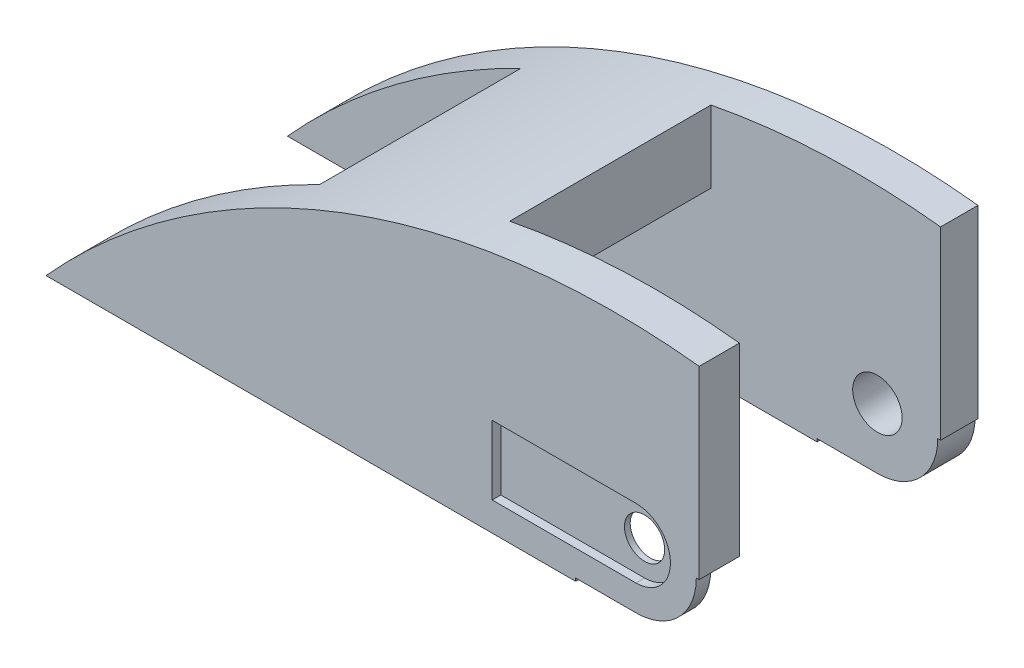
ISO-10303-21;
HEADER;
FILE_DESCRIPTION(('STEP AP214'),'2;1');
FILE_NAME('part.step','',(''),(''),'','','');
FILE_SCHEMA(('AUTOMOTIVE_DESIGN { 1 0 10303 214 1 1 1 1 }'));
ENDSEC;
DATA;
#1=APPLICATION_CONTEXT('core data for automotive mechanical design processes');
#2=APPLICATION_PROTOCOL_DEFINITION('international standard','automotive_design',2000,#1);
#3=PRODUCT_CONTEXT('',#1,'mechanical');
#4=PRODUCT('Part','Part','',(#3));
#5=PRODUCT_RELATED_PRODUCT_CATEGORY('part','',(#4));
#6=PRODUCT_DEFINITION_FORMATION('','',#4);
#7=PRODUCT_DEFINITION_CONTEXT('part definition',#1,'design');
#8=PRODUCT_DEFINITION('design','',#6,#7);
#9=PRODUCT_DEFINITION_SHAPE('','',#8);
#10=(LENGTH_UNIT() NAMED_UNIT(*) SI_UNIT(.MILLI.,.METRE.));
#11=(NAMED_UNIT(*) PLANE_ANGLE_UNIT() SI_UNIT($,.RADIAN.));
#12=(NAMED_UNIT(*) SI_UNIT($,.STERADIAN.) SOLID_ANGLE_UNIT());
#13=UNCERTAINTY_MEASURE_WITH_UNIT(LENGTH_MEASURE(1.E-05),#10,'distance_accuracy_value','');
#14=(GEOMETRIC_REPRESENTATION_CONTEXT(3) GLOBAL_UNCERTAINTY_ASSIGNED_CONTEXT((#13)) GLOBAL_UNIT_ASSIGNED_CONTEXT((#10,
#11,#12)) REPRESENTATION_CONTEXT('',''));
#15=CARTESIAN_POINT('',(0.,0.,0.));
#16=DIRECTION('',(0.,0.,1.));
#17=DIRECTION('',(1.,0.,0.));
#18=AXIS2_PLACEMENT_3D('',#15,#16,#17);
#19=CARTESIAN_POINT('',(0.,0.,0.));
#20=DIRECTION('',(0.,0.,1.));
#21=DIRECTION('',(1.,0.,0.));
#22=AXIS2_PLACEMENT_3D('',#19,#20,#21);
#23=PLANE('',#22);
#24=DIRECTION('',(-1.,0.,0.));
#25=VECTOR('',#24,1.);
#26=CARTESIAN_POINT('',(0.,0.,0.));
#27=LINE('',#26,#25);
#28=CARTESIAN_POINT('',(11.,0.,0.));
#29=VERTEX_POINT('',#28);
#30=CARTESIAN_POINT('',(10.5,0.,0.));
#31=VERTEX_POINT('',#30);
#32=EDGE_CURVE('E309',#29,#31,#27,.T.);
#33=ORIENTED_EDGE('',*,*,#32,.F.);
#34=DIRECTION('',(0.,-1.,0.));
#35=VECTOR('',#34,1.);
#36=CARTESIAN_POINT('',(11.,0.,0.));
#37=LINE('',#36,#35);
#38=CARTESIAN_POINT('',(11.,32.14,0.));
#39=VERTEX_POINT('',#38);
#40=EDGE_CURVE('E434',#39,#29,#37,.T.);
#41=ORIENTED_EDGE('',*,*,#40,.F.);
#42=CARTESIAN_POINT('',(-3.65048090000549,-100.467657861413,0.));
#43=DIRECTION('',(0.,0.,1.));
#44=DIRECTION('',(-1.,0.,0.));
#45=AXIS2_PLACEMENT_3D('',#42,#43,#44);
#46=CIRCLE('',#45,133.414495142361);
#47=CARTESIAN_POINT('',(-102.62,-11.,0.));
#48=VERTEX_POINT('',#47);
#49=EDGE_CURVE('E384',#39,#48,#46,.T.);
#50=ORIENTED_EDGE('',*,*,#49,.T.);
#51=DIRECTION('',(-1.,0.,0.));
#52=VECTOR('',#51,1.);
#53=CARTESIAN_POINT('',(0.,-11.,0.));
#54=LINE('',#53,#52);
#55=CARTESIAN_POINT('',(-10.5,-11.,0.));
#56=VERTEX_POINT('',#55);
#57=EDGE_CURVE('E426',#56,#48,#54,.T.);
#58=ORIENTED_EDGE('',*,*,#57,.F.);
#59=DIRECTION('',(0.,-1.,0.));
#60=VECTOR('',#59,1.);
#61=CARTESIAN_POINT('',(-10.5,0.,0.));
#62=LINE('',#61,#60);
#63=CARTESIAN_POINT('',(-10.5,-10.5,0.));
#64=VERTEX_POINT('',#63);
#65=EDGE_CURVE('E330',#64,#56,#62,.T.);
#66=ORIENTED_EDGE('',*,*,#65,.F.);
#67=DIRECTION('',(-1.,0.,0.));
#68=VECTOR('',#67,1.);
#69=CARTESIAN_POINT('',(0.,-10.5,0.));
#70=LINE('',#69,#68);
#71=CARTESIAN_POINT('',(0.,-10.5,0.));
#72=VERTEX_POINT('',#71);
#73=EDGE_CURVE('E326',#72,#64,#70,.T.);
#74=ORIENTED_EDGE('',*,*,#73,.F.);
#75=CARTESIAN_POINT('',(0.,0.,0.));
#76=DIRECTION('',(0.,0.,1.));
#77=DIRECTION('',(1.,0.,0.));
#78=AXIS2_PLACEMENT_3D('',#75,#76,#77);
#79=CIRCLE('',#78,10.5);
#80=EDGE_CURVE('E322',#72,#31,#79,.T.);
#81=ORIENTED_EDGE('',*,*,#80,.T.);
#82=EDGE_LOOP('',(#33,#41,#50,#58,#66,#74,#81));
#83=FACE_BOUND('',#82,.T.);
#84=CARTESIAN_POINT('',(0.,0.,0.));
#85=DIRECTION('',(0.,0.,1.));
#86=DIRECTION('',(1.,0.,0.));
#87=AXIS2_PLACEMENT_3D('',#84,#85,#86);
#88=CIRCLE('',#87,6.);
#89=CARTESIAN_POINT('',(0.,-6.,0.));
#90=VERTEX_POINT('',#89);
#91=CARTESIAN_POINT('',(0.,6.,0.));
#92=VERTEX_POINT('',#91);
#93=EDGE_CURVE('E256',#90,#92,#88,.T.);
#94=ORIENTED_EDGE('',*,*,#93,.F.);
#95=DIRECTION('',(-1.,0.,0.));
#96=VECTOR('',#95,1.);
#97=CARTESIAN_POINT('',(0.,-6.,0.));
#98=LINE('',#97,#96);
#99=CARTESIAN_POINT('',(-25.,-6.,0.));
#100=VERTEX_POINT('',#99);
#101=EDGE_CURVE('E65',#90,#100,#98,.T.);
#102=ORIENTED_EDGE('',*,*,#101,.T.);
#103=DIRECTION('',(0.,-1.,0.));
#104=VECTOR('',#103,1.);
#105=CARTESIAN_POINT('',(-25.,0.,0.));
#106=LINE('',#105,#104);
#107=CARTESIAN_POINT('',(-25.,6.,0.));
#108=VERTEX_POINT('',#107);
#109=EDGE_CURVE('E263',#108,#100,#106,.T.);
#110=ORIENTED_EDGE('',*,*,#109,.F.);
#111=DIRECTION('',(-1.,0.,0.));
#112=VECTOR('',#111,1.);
#113=CARTESIAN_POINT('',(0.,6.,0.));
#114=LINE('',#113,#112);
#115=EDGE_CURVE('E259',#92,#108,#114,.T.);
#116=ORIENTED_EDGE('',*,*,#115,.F.);
#117=EDGE_LOOP('',(#94,#102,#110,#116));
#118=FACE_BOUND('',#117,.T.);
#119=ADVANCED_FACE('F47',(#83,#118),#23,.T.);
#120=CARTESIAN_POINT('',(0.,0.,-21.75));
#121=DIRECTION('',(0.,0.,1.));
#122=DIRECTION('',(1.,0.,0.));
#123=AXIS2_PLACEMENT_3D('',#120,#121,#122);
#124=CYLINDRICAL_SURFACE('',#123,3.5);
#125=CARTESIAN_POINT('',(0.,0.,-2.5));
#126=DIRECTION('',(0.,0.,-1.));
#127=DIRECTION('',(0.,1.,0.));
#128=AXIS2_PLACEMENT_3D('',#125,#126,#127);
#129=CIRCLE('',#128,3.5);
#130=CARTESIAN_POINT('',(0.,3.5,-2.5));
#131=VERTEX_POINT('',#130);
#132=EDGE_CURVE('E51',#131,#131,#129,.T.);
#133=ORIENTED_EDGE('',*,*,#132,.T.);
#134=EDGE_LOOP('',(#133));
#135=FACE_BOUND('',#134,.T.);
#136=CARTESIAN_POINT('',(0.,0.,-1.5));
#137=DIRECTION('',(0.,0.,1.));
#138=DIRECTION('',(1.,0.,0.));
#139=AXIS2_PLACEMENT_3D('',#136,#137,#138);
#140=CIRCLE('',#139,3.5);
#141=CARTESIAN_POINT('',(3.5,0.,-1.5));
#142=VERTEX_POINT('',#141);
#143=EDGE_CURVE('E241',#142,#142,#140,.F.);
#144=ORIENTED_EDGE('',*,*,#143,.F.);
#145=EDGE_LOOP('',(#144));
#146=FACE_BOUND('',#145,.T.);
#147=ADVANCED_FACE('F607',(#135,#146),#124,.F.);
#148=CARTESIAN_POINT('',(12.,-12.,-7.));
#149=DIRECTION('',(0.,0.,1.));
#150=DIRECTION('',(0.,-1.,0.));
#151=AXIS2_PLACEMENT_3D('',#148,#149,#150);
#152=PLANE('',#151);
#153=DIRECTION('',(-1.,0.,0.));
#154=VECTOR('',#153,1.);
#155=CARTESIAN_POINT('',(12.,0.,-7.));
#156=LINE('',#155,#154);
#157=CARTESIAN_POINT('',(11.,0.,-7.00000000000001));
#158=VERTEX_POINT('',#157);
#159=CARTESIAN_POINT('',(9.5,0.,-7.));
#160=VERTEX_POINT('',#159);
#161=EDGE_CURVE('E361',#158,#160,#156,.T.);
#162=ORIENTED_EDGE('',*,*,#161,.T.);
#163=CARTESIAN_POINT('',(0.,0.,-7.));
#164=DIRECTION('',(0.,0.,-1.));
#165=DIRECTION('',(0.,1.,0.));
#166=AXIS2_PLACEMENT_3D('',#163,#164,#165);
#167=CIRCLE('',#166,9.5);
#168=CARTESIAN_POINT('',(-9.5,0.,-7.));
#169=VERTEX_POINT('',#168);
#170=EDGE_CURVE('E453',#169,#160,#167,.T.);
#171=ORIENTED_EDGE('',*,*,#170,.F.);
#172=DIRECTION('',(0.,1.,0.));
#173=VECTOR('',#172,1.);
#174=CARTESIAN_POINT('',(-9.5,-12.,-7.));
#175=LINE('',#174,#173);
#176=CARTESIAN_POINT('',(-9.5,-10.5,-7.00000000000001));
#177=VERTEX_POINT('',#176);
#178=EDGE_CURVE('E297',#177,#169,#175,.T.);
#179=ORIENTED_EDGE('',*,*,#178,.F.);
#180=DIRECTION('',(-1.,0.,0.));
#181=VECTOR('',#180,1.);
#182=CARTESIAN_POINT('',(12.,-10.5,-7.));
#183=LINE('',#182,#181);
#184=CARTESIAN_POINT('',(-10.5,-10.5,-7.00000000000001));
#185=VERTEX_POINT('',#184);
#186=EDGE_CURVE('E340',#177,#185,#183,.T.);
#187=ORIENTED_EDGE('',*,*,#186,.T.);
#188=DIRECTION('',(0.,-1.,0.));
#189=VECTOR('',#188,1.);
#190=CARTESIAN_POINT('',(-10.5,-12.,-7.));
#191=LINE('',#190,#189);
#192=CARTESIAN_POINT('',(-10.5,-11.,-7.00000000000001));
#193=VERTEX_POINT('',#192);
#194=EDGE_CURVE('E357',#185,#193,#191,.T.);
#195=ORIENTED_EDGE('',*,*,#194,.T.);
#196=DIRECTION('',(-1.,0.,0.));
#197=VECTOR('',#196,1.);
#198=CARTESIAN_POINT('',(0.,-11.,-7.));
#199=LINE('',#198,#197);
#200=CARTESIAN_POINT('',(-102.62,-11.,-7.));
#201=VERTEX_POINT('',#200);
#202=EDGE_CURVE('E427',#193,#201,#199,.T.);
#203=ORIENTED_EDGE('',*,*,#202,.T.);
#204=CARTESIAN_POINT('',(-3.65048090000549,-100.467657861413,-7.));
#205=DIRECTION('',(0.,0.,-1.));
#206=DIRECTION('',(-1.,0.,0.));
#207=AXIS2_PLACEMENT_3D('',#204,#205,#206);
#208=CIRCLE('',#207,133.414495142361);
#209=CARTESIAN_POINT('',(-62.0435913010327,19.489301802395,-7.));
#210=VERTEX_POINT('',#209);
#211=EDGE_CURVE('E479',#210,#201,#208,.F.);
#212=ORIENTED_EDGE('',*,*,#211,.F.);
#213=DIRECTION('',(0.,1.,0.));
#214=VECTOR('',#213,1.);
#215=CARTESIAN_POINT('',(-62.0435913010327,-11.,-7.));
#216=LINE('',#215,#214);
#217=CARTESIAN_POINT('',(-62.0435913010327,1.80739153991399,-7.));
#218=VERTEX_POINT('',#217);
#219=EDGE_CURVE('E368',#218,#210,#216,.T.);
#220=ORIENTED_EDGE('',*,*,#219,.F.);
#221=CARTESIAN_POINT('',(11.,-91.4878048780488,-6.99999999999999));
#222=DIRECTION('',(0.,0.,1.));
#223=DIRECTION('',(0.,-1.,0.));
#224=AXIS2_PLACEMENT_3D('',#221,#222,#223);
#225=CIRCLE('',#224,118.487804878049);
#226=CARTESIAN_POINT('',(-34.2965836217796,18.,-6.99999999999999));
#227=VERTEX_POINT('',#226);
#228=EDGE_CURVE('E419',#227,#218,#225,.T.);
#229=ORIENTED_EDGE('',*,*,#228,.F.);
#230=DIRECTION('',(1.,0.,0.));
#231=VECTOR('',#230,1.);
#232=CARTESIAN_POINT('',(0.,18.,-7.));
#233=LINE('',#232,#231);
#234=CARTESIAN_POINT('',(-28.9549396585655,18.,-7.));
#235=VERTEX_POINT('',#234);
#236=EDGE_CURVE('E430',#227,#235,#233,.T.);
#237=ORIENTED_EDGE('',*,*,#236,.T.);
#238=DIRECTION('',(0.,-1.,0.));
#239=VECTOR('',#238,1.);
#240=CARTESIAN_POINT('',(-28.9549396585655,38.5702227114121,-7.));
#241=LINE('',#240,#239);
#242=CARTESIAN_POINT('',(-28.9549396585655,30.5251353793884,-7.));
#243=VERTEX_POINT('',#242);
#244=EDGE_CURVE('E364',#243,#235,#241,.T.);
#245=ORIENTED_EDGE('',*,*,#244,.F.);
#246=CARTESIAN_POINT('',(-3.65048090000549,-100.467657861413,-7.));
#247=DIRECTION('',(0.,0.,-1.));
#248=DIRECTION('',(-1.,0.,0.));
#249=AXIS2_PLACEMENT_3D('',#246,#247,#248);
#250=CIRCLE('',#249,133.414495142361);
#251=CARTESIAN_POINT('',(11.,32.14,-7.));
#252=VERTEX_POINT('',#251);
#253=EDGE_CURVE('E467',#252,#243,#250,.F.);
#254=ORIENTED_EDGE('',*,*,#253,.F.);
#255=DIRECTION('',(0.,-1.,0.));
#256=VECTOR('',#255,1.);
#257=CARTESIAN_POINT('',(11.,-12.,-7.));
#258=LINE('',#257,#256);
#259=EDGE_CURVE('E448',#252,#158,#258,.T.);
#260=ORIENTED_EDGE('',*,*,#259,.T.);
#261=EDGE_LOOP('',(#162,#171,#179,#187,#195,#203,#212,#220,#229,#237,#245,#254,#260));
#262=FACE_BOUND('',#261,.T.);
#263=ADVANCED_FACE('F534',(#262),#152,.F.);
#264=CARTESIAN_POINT('',(0.,0.,-2.5));
#265=DIRECTION('',(0.,0.,-1.));
#266=DIRECTION('',(0.,1.,0.));
#267=AXIS2_PLACEMENT_3D('',#264,#265,#266);
#268=CYLINDRICAL_SURFACE('',#267,9.5);
#269=DIRECTION('',(0.,0.,-1.));
#270=VECTOR('',#269,1.);
#271=CARTESIAN_POINT('',(9.5,0.,-2.5));
#272=LINE('',#271,#270);
#273=CARTESIAN_POINT('',(9.5,0.,-2.5));
#274=VERTEX_POINT('',#273);
#275=EDGE_CURVE('E293',#274,#160,#272,.T.);
#276=ORIENTED_EDGE('',*,*,#275,.F.);
#277=CARTESIAN_POINT('',(0.,0.,-2.5));
#278=DIRECTION('',(0.,0.,-1.));
#279=DIRECTION('',(0.,1.,0.));
#280=AXIS2_PLACEMENT_3D('',#277,#278,#279);
#281=CIRCLE('',#280,9.5);
#282=CARTESIAN_POINT('',(-9.5,0.,-2.5));
#283=VERTEX_POINT('',#282);
#284=EDGE_CURVE('E452',#283,#274,#281,.T.);
#285=ORIENTED_EDGE('',*,*,#284,.F.);
#286=DIRECTION('',(0.,0.,-1.));
#287=VECTOR('',#286,1.);
#288=CARTESIAN_POINT('',(-9.5,0.,-2.5));
#289=LINE('',#288,#287);
#290=EDGE_CURVE('E289',#283,#169,#289,.T.);
#291=ORIENTED_EDGE('',*,*,#290,.T.);
#292=ORIENTED_EDGE('',*,*,#170,.T.);
#293=EDGE_LOOP('',(#276,#285,#291,#292));
#294=FACE_BOUND('',#293,.T.);
#295=ADVANCED_FACE('F590',(#294),#268,.F.);
#296=CARTESIAN_POINT('',(0.,-10.5,-48.5));
#297=DIRECTION('',(0.,1.,0.));
#298=DIRECTION('',(0.,0.,1.));
#299=AXIS2_PLACEMENT_3D('',#296,#297,#298);
#300=PLANE('',#299);
#301=DIRECTION('',(0.,0.,-1.));
#302=VECTOR('',#301,1.);
#303=CARTESIAN_POINT('',(-9.5,-10.5,-2.5));
#304=LINE('',#303,#302);
#305=CARTESIAN_POINT('',(-9.5,-10.5,-2.5));
#306=VERTEX_POINT('',#305);
#307=EDGE_CURVE('E286',#306,#177,#304,.T.);
#308=ORIENTED_EDGE('',*,*,#307,.F.);
#309=DIRECTION('',(-1.,0.,0.));
#310=VECTOR('',#309,1.);
#311=CARTESIAN_POINT('',(0.,-10.5,-2.5));
#312=LINE('',#311,#310);
#313=CARTESIAN_POINT('',(0.,-10.5,-2.50000000000002));
#314=VERTEX_POINT('',#313);
#315=EDGE_CURVE('E275',#314,#306,#312,.T.);
#316=ORIENTED_EDGE('',*,*,#315,.F.);
#317=DIRECTION('',(0.,0.,1.));
#318=VECTOR('',#317,1.);
#319=CARTESIAN_POINT('',(0.,-10.5,-48.5));
#320=LINE('',#319,#318);
#321=EDGE_CURVE('E321',#314,#72,#320,.T.);
#322=ORIENTED_EDGE('',*,*,#321,.T.);
#323=ORIENTED_EDGE('',*,*,#73,.T.);
#324=DIRECTION('',(0.,0.,1.));
#325=VECTOR('',#324,1.);
#326=CARTESIAN_POINT('',(-10.5,-10.5,-48.5));
#327=LINE('',#326,#325);
#328=EDGE_CURVE('E351',#185,#64,#327,.T.);
#329=ORIENTED_EDGE('',*,*,#328,.F.);
#330=ORIENTED_EDGE('',*,*,#186,.F.);
#331=EDGE_LOOP('',(#308,#316,#322,#323,#329,#330));
#332=FACE_BOUND('',#331,.T.);
#333=ADVANCED_FACE('F562',(#332),#300,.F.);
#334=CARTESIAN_POINT('',(12.,18.,-7.));
#335=DIRECTION('',(0.,1.,0.));
#336=DIRECTION('',(0.,0.,1.));
#337=AXIS2_PLACEMENT_3D('',#334,#335,#336);
#338=PLANE('',#337);
#339=DIRECTION('',(0.,0.,-1.));
#340=VECTOR('',#339,1.);
#341=CARTESIAN_POINT('',(-28.9549396585655,18.,-7.));
#342=LINE('',#341,#340);
#343=CARTESIAN_POINT('',(-28.9549396585655,18.,-42.));
#344=VERTEX_POINT('',#343);
#345=EDGE_CURVE('E373',#235,#344,#342,.T.);
#346=ORIENTED_EDGE('',*,*,#345,.F.);
#347=ORIENTED_EDGE('',*,*,#236,.F.);
#348=DIRECTION('',(0.,0.,1.));
#349=VECTOR('',#348,1.);
#350=CARTESIAN_POINT('',(-34.2965836217796,18.,-41.5));
#351=LINE('',#350,#349);
#352=CARTESIAN_POINT('',(-34.2965836217796,18.,-42.));
#353=VERTEX_POINT('',#352);
#354=EDGE_CURVE('E416',#353,#227,#351,.T.);
#355=ORIENTED_EDGE('',*,*,#354,.F.);
#356=DIRECTION('',(-1.,0.,0.));
#357=VECTOR('',#356,1.);
#358=CARTESIAN_POINT('',(0.,18.,-42.));
#359=LINE('',#358,#357);
#360=EDGE_CURVE('E405',#344,#353,#359,.T.);
#361=ORIENTED_EDGE('',*,*,#360,.F.);
#362=EDGE_LOOP('',(#346,#347,#355,#361));
#363=FACE_BOUND('',#362,.T.);
#364=ADVANCED_FACE('F542',(#363),#338,.F.);
#365=CARTESIAN_POINT('',(11.,0.,-48.5));
#366=DIRECTION('',(-1.,0.,0.));
#367=DIRECTION('',(0.,0.,1.));
#368=AXIS2_PLACEMENT_3D('',#365,#366,#367);
#369=PLANE('',#368);
#370=ORIENTED_EDGE('',*,*,#259,.F.);
#371=DIRECTION('',(0.,0.,1.));
#372=VECTOR('',#371,1.);
#373=CARTESIAN_POINT('',(11.,32.14,-48.5));
#374=LINE('',#373,#372);
#375=EDGE_CURVE('E398',#252,#39,#374,.T.);
#376=ORIENTED_EDGE('',*,*,#375,.T.);
#377=ORIENTED_EDGE('',*,*,#40,.T.);
#378=DIRECTION('',(0.,0.,1.));
#379=VECTOR('',#378,1.);
#380=CARTESIAN_POINT('',(11.,0.,-48.5));
#381=LINE('',#380,#379);
#382=EDGE_CURVE('E441',#158,#29,#381,.T.);
#383=ORIENTED_EDGE('',*,*,#382,.F.);
#384=EDGE_LOOP('',(#370,#376,#377,#383));
#385=FACE_BOUND('',#384,.T.);
#386=ADVANCED_FACE('F581',(#385),#369,.F.);
#387=CARTESIAN_POINT('',(0.,-11.,-7.));
#388=DIRECTION('',(0.,1.,0.));
#389=DIRECTION('',(-1.,0.,0.));
#390=AXIS2_PLACEMENT_3D('',#387,#388,#389);
#391=PLANE('',#390);
#392=ORIENTED_EDGE('',*,*,#202,.F.);
#393=DIRECTION('',(0.,0.,1.));
#394=VECTOR('',#393,1.);
#395=CARTESIAN_POINT('',(-10.5,-11.,-48.5));
#396=LINE('',#395,#394);
#397=EDGE_CURVE('E346',#193,#56,#396,.T.);
#398=ORIENTED_EDGE('',*,*,#397,.T.);
#399=ORIENTED_EDGE('',*,*,#57,.T.);
#400=DIRECTION('',(0.,0.,1.));
#401=VECTOR('',#400,1.);
#402=CARTESIAN_POINT('',(-102.62,-11.,-48.5));
#403=LINE('',#402,#401);
#404=EDGE_CURVE('E392',#201,#48,#403,.T.);
#405=ORIENTED_EDGE('',*,*,#404,.F.);
#406=EDGE_LOOP('',(#392,#398,#399,#405));
#407=FACE_BOUND('',#406,.T.);
#408=ADVANCED_FACE('F578',(#407),#391,.F.);
#409=CARTESIAN_POINT('',(11.,-91.4878048780488,-41.5));
#410=DIRECTION('',(0.,0.,1.));
#411=DIRECTION('',(1.,0.,0.));
#412=AXIS2_PLACEMENT_3D('',#409,#410,#411);
#413=CYLINDRICAL_SURFACE('',#412,118.487804878049);
#414=DIRECTION('',(0.,0.,1.));
#415=VECTOR('',#414,1.);
#416=CARTESIAN_POINT('',(-62.0435913010327,1.80739153991399,-41.5));
#417=LINE('',#416,#415);
#418=CARTESIAN_POINT('',(-62.0435913010327,1.80739153991399,-42.));
#419=VERTEX_POINT('',#418);
#420=EDGE_CURVE('E381',#419,#218,#417,.T.);
#421=ORIENTED_EDGE('',*,*,#420,.F.);
#422=CARTESIAN_POINT('',(11.,-91.4878048780488,-42.));
#423=DIRECTION('',(0.,0.,1.));
#424=DIRECTION('',(1.,0.,0.));
#425=AXIS2_PLACEMENT_3D('',#422,#423,#424);
#426=CIRCLE('',#425,118.487804878049);
#427=EDGE_CURVE('E408',#353,#419,#426,.T.);
#428=ORIENTED_EDGE('',*,*,#427,.F.);
#429=ORIENTED_EDGE('',*,*,#354,.T.);
#430=ORIENTED_EDGE('',*,*,#228,.T.);
#431=EDGE_LOOP('',(#421,#428,#429,#430));
#432=FACE_BOUND('',#431,.T.);
#433=ADVANCED_FACE('F537',(#432),#413,.F.);
#434=CARTESIAN_POINT('',(-3.65048090000549,-100.467657861413,-48.5));
#435=DIRECTION('',(0.,0.,1.));
#436=DIRECTION('',(1.,0.,0.));
#437=AXIS2_PLACEMENT_3D('',#434,#435,#436);
#438=CYLINDRICAL_SURFACE('',#437,133.414495142361);
#439=DIRECTION('',(0.,0.,1.));
#440=VECTOR('',#439,1.);
#441=CARTESIAN_POINT('',(-62.0435913010327,19.489301802395,-48.5));
#442=LINE('',#441,#440);
#443=CARTESIAN_POINT('',(-62.0435913010327,19.489301802395,-42.));
#444=VERTEX_POINT('',#443);
#445=EDGE_CURVE('E475',#444,#210,#442,.T.);
#446=ORIENTED_EDGE('',*,*,#445,.T.);
#447=ORIENTED_EDGE('',*,*,#211,.T.);
#448=ORIENTED_EDGE('',*,*,#404,.T.);
#449=ORIENTED_EDGE('',*,*,#49,.F.);
#450=ORIENTED_EDGE('',*,*,#375,.F.);
#451=ORIENTED_EDGE('',*,*,#253,.T.);
#452=DIRECTION('',(0.,0.,1.));
#453=VECTOR('',#452,1.);
#454=CARTESIAN_POINT('',(-28.9549396585655,30.5251353793883,-48.5));
#455=LINE('',#454,#453);
#456=CARTESIAN_POINT('',(-28.9549396585655,30.5251353793884,-42.));
#457=VERTEX_POINT('',#456);
#458=EDGE_CURVE('E463',#243,#457,#455,.F.);
#459=ORIENTED_EDGE('',*,*,#458,.T.);
#460=CARTESIAN_POINT('',(-3.65048090000549,-100.467657861413,-42.));
#461=DIRECTION('',(0.,0.,-1.));
#462=DIRECTION('',(-1.,0.,0.));
#463=AXIS2_PLACEMENT_3D('',#460,#461,#462);
#464=CIRCLE('',#463,133.414495142361);
#465=CARTESIAN_POINT('',(11.,32.14,-42.));
#466=VERTEX_POINT('',#465);
#467=EDGE_CURVE('E457',#466,#457,#464,.F.);
#468=ORIENTED_EDGE('',*,*,#467,.F.);
#469=CARTESIAN_POINT('',(11.,32.14,-48.5));
#470=VERTEX_POINT('',#469);
#471=EDGE_CURVE('E393',#470,#466,#374,.T.);
#472=ORIENTED_EDGE('',*,*,#471,.F.);
#473=CARTESIAN_POINT('',(-3.65048090000549,-100.467657861413,-48.5));
#474=DIRECTION('',(0.,0.,1.));
#475=DIRECTION('',(-1.,0.,0.));
#476=AXIS2_PLACEMENT_3D('',#473,#474,#475);
#477=CIRCLE('',#476,133.414495142361);
#478=CARTESIAN_POINT('',(-102.62,-11.,-48.5));
#479=VERTEX_POINT('',#478);
#480=EDGE_CURVE('E388',#470,#479,#477,.T.);
#481=ORIENTED_EDGE('',*,*,#480,.T.);
#482=CARTESIAN_POINT('',(-102.62,-11.,-42.));
#483=VERTEX_POINT('',#482);
#484=EDGE_CURVE('E399',#479,#483,#403,.T.);
#485=ORIENTED_EDGE('',*,*,#484,.T.);
#486=CARTESIAN_POINT('',(-3.65048090000549,-100.467657861413,-42.));
#487=DIRECTION('',(0.,0.,-1.));
#488=DIRECTION('',(-1.,0.,0.));
#489=AXIS2_PLACEMENT_3D('',#486,#487,#488);
#490=CIRCLE('',#489,133.414495142361);
#491=EDGE_CURVE('E471',#444,#483,#490,.F.);
#492=ORIENTED_EDGE('',*,*,#491,.F.);
#493=EDGE_LOOP('',(#446,#447,#448,#449,#450,#451,#459,#468,#472,#481,#485,#492));
#494=FACE_BOUND('',#493,.T.);
#495=ADVANCED_FACE('F517',(#494),#438,.T.);
#496=CARTESIAN_POINT('',(0.,0.,-48.5));
#497=DIRECTION('',(0.,0.,-1.));
#498=DIRECTION('',(-1.,0.,0.));
#499=AXIS2_PLACEMENT_3D('',#496,#497,#498);
#500=PLANE('',#499);
#501=CARTESIAN_POINT('',(0.,0.,-48.5));
#502=DIRECTION('',(0.,0.,1.));
#503=DIRECTION('',(1.,0.,0.));
#504=AXIS2_PLACEMENT_3D('',#501,#502,#503);
#505=CIRCLE('',#504,4.3);
#506=CARTESIAN_POINT('',(4.3,0.,-48.5));
#507=VERTEX_POINT('',#506);
#508=EDGE_CURVE('E300',#507,#507,#505,.T.);
#509=ORIENTED_EDGE('',*,*,#508,.T.);
#510=EDGE_LOOP('',(#509));
#511=FACE_BOUND('',#510,.T.);
#512=DIRECTION('',(-1.,0.,0.));
#513=VECTOR('',#512,1.);
#514=CARTESIAN_POINT('',(0.,0.,-48.5));
#515=LINE('',#514,#513);
#516=CARTESIAN_POINT('',(11.,0.,-48.5));
#517=VERTEX_POINT('',#516);
#518=CARTESIAN_POINT('',(10.5,0.,-48.5));
#519=VERTEX_POINT('',#518);
#520=EDGE_CURVE('E317',#517,#519,#515,.T.);
#521=ORIENTED_EDGE('',*,*,#520,.T.);
#522=CARTESIAN_POINT('',(0.,0.,-48.5));
#523=DIRECTION('',(0.,0.,1.));
#524=DIRECTION('',(1.,0.,0.));
#525=AXIS2_PLACEMENT_3D('',#522,#523,#524);
#526=CIRCLE('',#525,10.5);
#527=CARTESIAN_POINT('',(0.,-10.5,-48.5));
#528=VERTEX_POINT('',#527);
#529=EDGE_CURVE('E305',#528,#519,#526,.T.);
#530=ORIENTED_EDGE('',*,*,#529,.F.);
#531=DIRECTION('',(-1.,0.,0.));
#532=VECTOR('',#531,1.);
#533=CARTESIAN_POINT('',(0.,-10.5,-48.5));
#534=LINE('',#533,#532);
#535=CARTESIAN_POINT('',(-10.5,-10.5,-48.5));
#536=VERTEX_POINT('',#535);
#537=EDGE_CURVE('E308',#528,#536,#534,.T.);
#538=ORIENTED_EDGE('',*,*,#537,.T.);
#539=DIRECTION('',(0.,-1.,0.));
#540=VECTOR('',#539,1.);
#541=CARTESIAN_POINT('',(-10.5,0.,-48.5));
#542=LINE('',#541,#540);
#543=CARTESIAN_POINT('',(-10.5,-11.,-48.5));
#544=VERTEX_POINT('',#543);
#545=EDGE_CURVE('E313',#536,#544,#542,.T.);
#546=ORIENTED_EDGE('',*,*,#545,.T.);
#547=DIRECTION('',(-1.,0.,0.));
#548=VECTOR('',#547,1.);
#549=CARTESIAN_POINT('',(0.,-11.,-48.5));
#550=LINE('',#549,#548);
#551=EDGE_CURVE('E423',#544,#479,#550,.T.);
#552=ORIENTED_EDGE('',*,*,#551,.T.);
#553=ORIENTED_EDGE('',*,*,#480,.F.);
#554=DIRECTION('',(0.,-1.,0.));
#555=VECTOR('',#554,1.);
#556=CARTESIAN_POINT('',(11.,0.,-48.5));
#557=LINE('',#556,#555);
#558=EDGE_CURVE('E437',#470,#517,#557,.T.);
#559=ORIENTED_EDGE('',*,*,#558,.T.);
#560=EDGE_LOOP('',(#521,#530,#538,#546,#552,#553,#559));
#561=FACE_BOUND('',#560,.T.);
#562=ADVANCED_FACE('F519',(#511,#561),#500,.T.);
#563=CARTESIAN_POINT('',(0.,0.,-2.5));
#564=DIRECTION('',(0.,0.,-1.));
#565=DIRECTION('',(0.,1.,0.));
#566=AXIS2_PLACEMENT_3D('',#563,#564,#565);
#567=PLANE('',#566);
#568=ORIENTED_EDGE('',*,*,#132,.F.);
#569=EDGE_LOOP('',(#568));
#570=FACE_BOUND('',#569,.T.);
#571=ORIENTED_EDGE('',*,*,#284,.T.);
#572=DIRECTION('',(-1.,0.,0.));
#573=VECTOR('',#572,1.);
#574=CARTESIAN_POINT('',(0.,0.,-2.5));
#575=LINE('',#574,#573);
#576=CARTESIAN_POINT('',(10.5,0.,-2.5));
#577=VERTEX_POINT('',#576);
#578=EDGE_CURVE('E280',#577,#274,#575,.T.);
#579=ORIENTED_EDGE('',*,*,#578,.F.);
#580=CARTESIAN_POINT('',(0.,0.,-2.5));
#581=DIRECTION('',(0.,0.,1.));
#582=DIRECTION('',(1.,0.,0.));
#583=AXIS2_PLACEMENT_3D('',#580,#581,#582);
#584=CIRCLE('',#583,10.5);
#585=EDGE_CURVE('E73',#314,#577,#584,.T.);
#586=ORIENTED_EDGE('',*,*,#585,.F.);
#587=ORIENTED_EDGE('',*,*,#315,.T.);
#588=DIRECTION('',(0.,-1.,0.));
#589=VECTOR('',#588,1.);
#590=CARTESIAN_POINT('',(-9.5,0.,-2.5));
#591=LINE('',#590,#589);
#592=EDGE_CURVE('E283',#283,#306,#591,.T.);
#593=ORIENTED_EDGE('',*,*,#592,.F.);
#594=EDGE_LOOP('',(#571,#579,#586,#587,#593));
#595=FACE_BOUND('',#594,.T.);
#596=ADVANCED_FACE('F49',(#570,#595),#567,.T.);
#597=ORIENTED_EDGE('',*,*,#471,.T.);
#598=DIRECTION('',(0.,1.,0.));
#599=VECTOR('',#598,1.);
#600=CARTESIAN_POINT('',(11.,0.,-42.));
#601=LINE('',#600,#599);
#602=CARTESIAN_POINT('',(11.,0.,-42.));
#603=VERTEX_POINT('',#602);
#604=EDGE_CURVE('E397',#603,#466,#601,.T.);
#605=ORIENTED_EDGE('',*,*,#604,.F.);
#606=EDGE_CURVE('E445',#517,#603,#381,.T.);
#607=ORIENTED_EDGE('',*,*,#606,.F.);
#608=ORIENTED_EDGE('',*,*,#558,.F.);
#609=EDGE_LOOP('',(#597,#605,#607,#608));
#610=FACE_BOUND('',#609,.T.);
#611=ADVANCED_FACE('F513',(#610),#369,.F.);
#612=ORIENTED_EDGE('',*,*,#551,.F.);
#613=CARTESIAN_POINT('',(-10.5,-11.,-42.));
#614=VERTEX_POINT('',#613);
#615=EDGE_CURVE('E342',#544,#614,#396,.T.);
#616=ORIENTED_EDGE('',*,*,#615,.T.);
#617=DIRECTION('',(1.,0.,0.));
#618=VECTOR('',#617,1.);
#619=CARTESIAN_POINT('',(0.,-11.,-42.));
#620=LINE('',#619,#618);
#621=EDGE_CURVE('E412',#483,#614,#620,.T.);
#622=ORIENTED_EDGE('',*,*,#621,.F.);
#623=ORIENTED_EDGE('',*,*,#484,.F.);
#624=EDGE_LOOP('',(#612,#616,#622,#623));
#625=FACE_BOUND('',#624,.T.);
#626=ADVANCED_FACE('F502',(#625),#391,.F.);
#627=CARTESIAN_POINT('',(0.,0.,-42.));
#628=DIRECTION('',(0.,0.,1.));
#629=DIRECTION('',(1.,0.,0.));
#630=AXIS2_PLACEMENT_3D('',#627,#628,#629);
#631=PLANE('',#630);
#632=CARTESIAN_POINT('',(0.,0.,-42.));
#633=DIRECTION('',(0.,0.,1.));
#634=DIRECTION('',(1.,0.,0.));
#635=AXIS2_PLACEMENT_3D('',#632,#633,#634);
#636=CIRCLE('',#635,4.3);
#637=CARTESIAN_POINT('',(4.3,0.,-42.));
#638=VERTEX_POINT('',#637);
#639=EDGE_CURVE('E304',#638,#638,#636,.T.);
#640=ORIENTED_EDGE('',*,*,#639,.F.);
#641=EDGE_LOOP('',(#640));
#642=FACE_BOUND('',#641,.T.);
#643=DIRECTION('',(-1.,0.,0.));
#644=VECTOR('',#643,1.);
#645=CARTESIAN_POINT('',(0.,0.,-42.));
#646=LINE('',#645,#644);
#647=CARTESIAN_POINT('',(10.5,0.,-42.));
#648=VERTEX_POINT('',#647);
#649=EDGE_CURVE('E11',#603,#648,#646,.T.);
#650=ORIENTED_EDGE('',*,*,#649,.F.);
#651=ORIENTED_EDGE('',*,*,#604,.T.);
#652=ORIENTED_EDGE('',*,*,#467,.T.);
#653=DIRECTION('',(0.,-1.,0.));
#654=VECTOR('',#653,1.);
#655=CARTESIAN_POINT('',(-28.9549396585655,38.5702227114121,-42.));
#656=LINE('',#655,#654);
#657=EDGE_CURVE('E369',#457,#344,#656,.T.);
#658=ORIENTED_EDGE('',*,*,#657,.T.);
#659=ORIENTED_EDGE('',*,*,#360,.T.);
#660=ORIENTED_EDGE('',*,*,#427,.T.);
#661=DIRECTION('',(0.,1.,0.));
#662=VECTOR('',#661,1.);
#663=CARTESIAN_POINT('',(-62.0435913010327,-11.,-42.));
#664=LINE('',#663,#662);
#665=EDGE_CURVE('E365',#419,#444,#664,.T.);
#666=ORIENTED_EDGE('',*,*,#665,.T.);
#667=ORIENTED_EDGE('',*,*,#491,.T.);
#668=ORIENTED_EDGE('',*,*,#621,.T.);
#669=DIRECTION('',(0.,-1.,0.));
#670=VECTOR('',#669,1.);
#671=CARTESIAN_POINT('',(-10.5,0.,-42.));
#672=LINE('',#671,#670);
#673=CARTESIAN_POINT('',(-10.5,-10.5,-42.));
#674=VERTEX_POINT('',#673);
#675=EDGE_CURVE('E486',#674,#614,#672,.T.);
#676=ORIENTED_EDGE('',*,*,#675,.F.);
#677=DIRECTION('',(-1.,0.,0.));
#678=VECTOR('',#677,1.);
#679=CARTESIAN_POINT('',(0.,-10.5,-42.));
#680=LINE('',#679,#678);
#681=CARTESIAN_POINT('',(0.,-10.5,-42.));
#682=VERTEX_POINT('',#681);
#683=EDGE_CURVE('E483',#682,#674,#680,.T.);
#684=ORIENTED_EDGE('',*,*,#683,.F.);
#685=CARTESIAN_POINT('',(0.,0.,-42.));
#686=DIRECTION('',(0.,0.,1.));
#687=DIRECTION('',(1.,0.,0.));
#688=AXIS2_PLACEMENT_3D('',#685,#686,#687);
#689=CIRCLE('',#688,10.5);
#690=EDGE_CURVE('E57',#682,#648,#689,.T.);
#691=ORIENTED_EDGE('',*,*,#690,.T.);
#692=EDGE_LOOP('',(#650,#651,#652,#658,#659,#660,#666,#667,#668,#676,#684,#691));
#693=FACE_BOUND('',#692,.T.);
#694=ADVANCED_FACE('F498',(#642,#693),#631,.T.);
#695=CARTESIAN_POINT('',(-28.9549396585655,38.5702227114121,-7.));
#696=DIRECTION('',(1.,0.,0.));
#697=DIRECTION('',(0.,0.,-1.));
#698=AXIS2_PLACEMENT_3D('',#695,#696,#697);
#699=PLANE('',#698);
#700=ORIENTED_EDGE('',*,*,#345,.T.);
#701=ORIENTED_EDGE('',*,*,#657,.F.);
#702=ORIENTED_EDGE('',*,*,#458,.F.);
#703=ORIENTED_EDGE('',*,*,#244,.T.);
#704=EDGE_LOOP('',(#700,#701,#702,#703));
#705=FACE_BOUND('',#704,.T.);
#706=ADVANCED_FACE('F501',(#705),#699,.T.);
#707=CARTESIAN_POINT('',(-62.0435913010327,-11.,-7.));
#708=DIRECTION('',(-1.,0.,0.));
#709=DIRECTION('',(0.,0.,1.));
#710=AXIS2_PLACEMENT_3D('',#707,#708,#709);
#711=PLANE('',#710);
#712=ORIENTED_EDGE('',*,*,#420,.T.);
#713=ORIENTED_EDGE('',*,*,#219,.T.);
#714=ORIENTED_EDGE('',*,*,#445,.F.);
#715=ORIENTED_EDGE('',*,*,#665,.F.);
#716=EDGE_LOOP('',(#712,#713,#714,#715));
#717=FACE_BOUND('',#716,.T.);
#718=ADVANCED_FACE('F530',(#717),#711,.T.);
#719=CARTESIAN_POINT('',(0.,0.,-48.5));
#720=DIRECTION('',(0.,1.,0.));
#721=DIRECTION('',(0.,0.,1.));
#722=AXIS2_PLACEMENT_3D('',#719,#720,#721);
#723=PLANE('',#722);
#724=ORIENTED_EDGE('',*,*,#649,.T.);
#725=DIRECTION('',(0.,0.,1.));
#726=VECTOR('',#725,1.);
#727=CARTESIAN_POINT('',(10.5,0.,-48.5));
#728=LINE('',#727,#726);
#729=EDGE_CURVE('E336',#519,#648,#728,.T.);
#730=ORIENTED_EDGE('',*,*,#729,.F.);
#731=ORIENTED_EDGE('',*,*,#520,.F.);
#732=ORIENTED_EDGE('',*,*,#606,.T.);
#733=EDGE_LOOP('',(#724,#730,#731,#732));
#734=FACE_BOUND('',#733,.T.);
#735=ADVANCED_FACE('F631',(#734),#723,.F.);
#736=ORIENTED_EDGE('',*,*,#683,.T.);
#737=EDGE_CURVE('E347',#536,#674,#327,.T.);
#738=ORIENTED_EDGE('',*,*,#737,.F.);
#739=ORIENTED_EDGE('',*,*,#537,.F.);
#740=EDGE_CURVE('E352',#528,#682,#320,.T.);
#741=ORIENTED_EDGE('',*,*,#740,.T.);
#742=EDGE_LOOP('',(#736,#738,#739,#741));
#743=FACE_BOUND('',#742,.T.);
#744=ADVANCED_FACE('F623',(#743),#300,.F.);
#745=CARTESIAN_POINT('',(-10.5,0.,-48.5));
#746=DIRECTION('',(-1.,0.,0.));
#747=DIRECTION('',(0.,0.,1.));
#748=AXIS2_PLACEMENT_3D('',#745,#746,#747);
#749=PLANE('',#748);
#750=ORIENTED_EDGE('',*,*,#675,.T.);
#751=ORIENTED_EDGE('',*,*,#615,.F.);
#752=ORIENTED_EDGE('',*,*,#545,.F.);
#753=ORIENTED_EDGE('',*,*,#737,.T.);
#754=EDGE_LOOP('',(#750,#751,#752,#753));
#755=FACE_BOUND('',#754,.T.);
#756=ADVANCED_FACE('F630',(#755),#749,.F.);
#757=CARTESIAN_POINT('',(0.,0.,-48.5));
#758=DIRECTION('',(0.,0.,1.));
#759=DIRECTION('',(1.,0.,0.));
#760=AXIS2_PLACEMENT_3D('',#757,#758,#759);
#761=CYLINDRICAL_SURFACE('',#760,10.5);
#762=ORIENTED_EDGE('',*,*,#740,.F.);
#763=ORIENTED_EDGE('',*,*,#529,.T.);
#764=ORIENTED_EDGE('',*,*,#729,.T.);
#765=ORIENTED_EDGE('',*,*,#690,.F.);
#766=EDGE_LOOP('',(#762,#763,#764,#765));
#767=FACE_BOUND('',#766,.T.);
#768=ADVANCED_FACE('F637',(#767),#761,.T.);
#769=ORIENTED_EDGE('',*,*,#585,.T.);
#770=EDGE_CURVE('E341',#577,#31,#728,.T.);
#771=ORIENTED_EDGE('',*,*,#770,.T.);
#772=ORIENTED_EDGE('',*,*,#80,.F.);
#773=ORIENTED_EDGE('',*,*,#321,.F.);
#774=EDGE_LOOP('',(#769,#771,#772,#773));
#775=FACE_BOUND('',#774,.T.);
#776=ADVANCED_FACE('F567',(#775),#761,.T.);
#777=ORIENTED_EDGE('',*,*,#382,.T.);
#778=ORIENTED_EDGE('',*,*,#32,.T.);
#779=ORIENTED_EDGE('',*,*,#770,.F.);
#780=ORIENTED_EDGE('',*,*,#578,.T.);
#781=ORIENTED_EDGE('',*,*,#275,.T.);
#782=ORIENTED_EDGE('',*,*,#161,.F.);
#783=EDGE_LOOP('',(#777,#778,#779,#780,#781,#782));
#784=FACE_BOUND('',#783,.T.);
#785=ADVANCED_FACE('F584',(#784),#723,.F.);
#786=ORIENTED_EDGE('',*,*,#328,.T.);
#787=ORIENTED_EDGE('',*,*,#65,.T.);
#788=ORIENTED_EDGE('',*,*,#397,.F.);
#789=ORIENTED_EDGE('',*,*,#194,.F.);
#790=EDGE_LOOP('',(#786,#787,#788,#789));
#791=FACE_BOUND('',#790,.T.);
#792=ADVANCED_FACE('F574',(#791),#749,.F.);
#793=CARTESIAN_POINT('',(0.,0.,-48.5));
#794=DIRECTION('',(0.,0.,1.));
#795=DIRECTION('',(1.,0.,0.));
#796=AXIS2_PLACEMENT_3D('',#793,#794,#795);
#797=CYLINDRICAL_SURFACE('',#796,4.3);
#798=CARTESIAN_POINT('',(4.3,0.,-42.));
#799=CARTESIAN_POINT('',(4.3,0.,-42.0677083333333));
#800=CARTESIAN_POINT('',(4.3,0.,-42.1354166666667));
#801=CARTESIAN_POINT('',(4.3,0.,-42.2708333333333));
#802=CARTESIAN_POINT('',(4.3,0.,-42.3385416666667));
#803=CARTESIAN_POINT('',(4.3,0.,-42.4739583333333));
#804=CARTESIAN_POINT('',(4.3,0.,-42.5416666666667));
#805=CARTESIAN_POINT('',(4.3,0.,-42.6770833333333));
#806=CARTESIAN_POINT('',(4.3,0.,-42.7447916666667));
#807=CARTESIAN_POINT('',(4.3,0.,-42.8802083333333));
#808=CARTESIAN_POINT('',(4.3,0.,-42.9479166666667));
#809=CARTESIAN_POINT('',(4.3,0.,-43.0833333333333));
#810=CARTESIAN_POINT('',(4.3,0.,-43.1510416666667));
#811=CARTESIAN_POINT('',(4.3,0.,-43.2864583333333));
#812=CARTESIAN_POINT('',(4.3,0.,-43.3541666666667));
#813=CARTESIAN_POINT('',(4.3,0.,-43.4895833333333));
#814=CARTESIAN_POINT('',(4.3,0.,-43.5572916666667));
#815=CARTESIAN_POINT('',(4.3,0.,-43.6927083333333));
#816=CARTESIAN_POINT('',(4.3,0.,-43.7604166666667));
#817=CARTESIAN_POINT('',(4.3,0.,-43.8958333333333));
#818=CARTESIAN_POINT('',(4.3,0.,-43.9635416666667));
#819=CARTESIAN_POINT('',(4.3,0.,-44.0989583333333));
#820=CARTESIAN_POINT('',(4.3,0.,-44.1666666666667));
#821=CARTESIAN_POINT('',(4.3,0.,-44.3020833333333));
#822=CARTESIAN_POINT('',(4.3,0.,-44.3697916666667));
#823=CARTESIAN_POINT('',(4.3,0.,-44.5052083333333));
#824=CARTESIAN_POINT('',(4.3,0.,-44.5729166666667));
#825=CARTESIAN_POINT('',(4.3,0.,-44.7083333333333));
#826=CARTESIAN_POINT('',(4.3,0.,-44.7760416666667));
#827=CARTESIAN_POINT('',(4.3,0.,-44.9114583333333));
#828=CARTESIAN_POINT('',(4.3,0.,-44.9791666666667));
#829=CARTESIAN_POINT('',(4.3,0.,-45.1145833333333));
#830=CARTESIAN_POINT('',(4.3,0.,-45.1822916666667));
#831=CARTESIAN_POINT('',(4.3,0.,-45.3177083333333));
#832=CARTESIAN_POINT('',(4.3,0.,-45.3854166666667));
#833=CARTESIAN_POINT('',(4.3,0.,-45.5208333333333));
#834=CARTESIAN_POINT('',(4.3,0.,-45.5885416666667));
#835=CARTESIAN_POINT('',(4.3,0.,-45.7239583333333));
#836=CARTESIAN_POINT('',(4.3,0.,-45.7916666666667));
#837=CARTESIAN_POINT('',(4.3,0.,-45.9270833333333));
#838=CARTESIAN_POINT('',(4.3,0.,-45.9947916666667));
#839=CARTESIAN_POINT('',(4.3,0.,-46.1302083333333));
#840=CARTESIAN_POINT('',(4.3,0.,-46.1979166666667));
#841=CARTESIAN_POINT('',(4.3,0.,-46.3333333333333));
#842=CARTESIAN_POINT('',(4.3,0.,-46.4010416666667));
#843=CARTESIAN_POINT('',(4.3,0.,-46.5364583333333));
#844=CARTESIAN_POINT('',(4.3,0.,-46.6041666666667));
#845=CARTESIAN_POINT('',(4.3,0.,-46.7395833333333));
#846=CARTESIAN_POINT('',(4.3,0.,-46.8072916666667));
#847=CARTESIAN_POINT('',(4.3,0.,-46.9427083333333));
#848=CARTESIAN_POINT('',(4.3,0.,-47.0104166666667));
#849=CARTESIAN_POINT('',(4.3,0.,-47.1458333333333));
#850=CARTESIAN_POINT('',(4.3,0.,-47.2135416666667));
#851=CARTESIAN_POINT('',(4.3,0.,-47.3489583333333));
#852=CARTESIAN_POINT('',(4.3,0.,-47.4166666666667));
#853=CARTESIAN_POINT('',(4.3,0.,-47.5520833333333));
#854=CARTESIAN_POINT('',(4.3,0.,-47.6197916666667));
#855=CARTESIAN_POINT('',(4.3,0.,-47.7552083333333));
#856=CARTESIAN_POINT('',(4.3,0.,-47.8229166666667));
#857=CARTESIAN_POINT('',(4.3,0.,-47.9583333333333));
#858=CARTESIAN_POINT('',(4.3,0.,-48.0260416666667));
#859=CARTESIAN_POINT('',(4.3,0.,-48.1614583333333));
#860=CARTESIAN_POINT('',(4.3,0.,-48.2291666666667));
#861=CARTESIAN_POINT('',(4.3,0.,-48.3645833333333));
#862=CARTESIAN_POINT('',(4.3,0.,-48.4322916666667));
#863=CARTESIAN_POINT('',(4.3,0.,-48.5));
#864=B_SPLINE_CURVE_WITH_KNOTS('',3,(#798,#799,#800,#801,#802,#803,#804,#805,#806,#807,#808,
#809,#810,#811,#812,#813,#814,#815,#816,#817,#818,#819,#820,#821,#822,#823,#824,#825,#826,#827,
#828,#829,#830,#831,#832,#833,#834,#835,#836,#837,#838,#839,#840,#841,#842,#843,#844,#845,#846,
#847,#848,#849,#850,#851,#852,#853,#854,#855,#856,#857,#858,#859,#860,#861,#862,#863),
.UNSPECIFIED.,.F.,.F.,(4,2,2,2,2,2,2,2,2,2,2,2,2,2,2,2,2,2,2,2,2,2,2,2,2,2,2,2,2,2,2,2,4),(0.,
0.203125000000005,0.406250000000004,0.609375000000002,0.812500000000001,1.015625,1.21875,
1.421875,1.625,1.828125,2.03125000000001,2.234375,2.4375,2.640625,2.84375,3.046875,3.25,
3.453125,3.65625,3.85937500000001,4.0625,4.265625,4.46875,4.67187500000001,4.875,5.078125,
5.28125,5.484375,5.68750000000001,5.890625,6.09375,6.296875,6.5),.UNSPECIFIED.);
#865=EDGE_CURVE('BSEAM495',#638,#507,#864,.T.);
#866=ORIENTED_EDGE('',*,*,#639,.T.);
#867=ORIENTED_EDGE('',*,*,#508,.F.);
#868=ORIENTED_EDGE('',*,*,#865,.T.);
#869=ORIENTED_EDGE('',*,*,#865,.F.);
#870=EDGE_LOOP('',(#866,#868,#867,#869));
#871=FACE_BOUND('',#870,.T.);
#872=ADVANCED_FACE('F495',(#871),#797,.F.);
#873=CARTESIAN_POINT('',(-9.5,0.,-2.5));
#874=DIRECTION('',(1.,0.,0.));
#875=DIRECTION('',(0.,0.,-1.));
#876=AXIS2_PLACEMENT_3D('',#873,#874,#875);
#877=PLANE('',#876);
#878=ORIENTED_EDGE('',*,*,#178,.T.);
#879=ORIENTED_EDGE('',*,*,#290,.F.);
#880=ORIENTED_EDGE('',*,*,#592,.T.);
#881=ORIENTED_EDGE('',*,*,#307,.T.);
#882=EDGE_LOOP('',(#878,#879,#880,#881));
#883=FACE_BOUND('',#882,.T.);
#884=ADVANCED_FACE('F594',(#883),#877,.T.);
#885=CARTESIAN_POINT('',(0.,-6.,-1.5));
#886=DIRECTION('',(0.,1.,0.));
#887=DIRECTION('',(-1.,0.,0.));
#888=AXIS2_PLACEMENT_3D('',#885,#886,#887);
#889=PLANE('',#888);
#890=ORIENTED_EDGE('',*,*,#101,.F.);
#891=DIRECTION('',(0.,0.,1.));
#892=VECTOR('',#891,1.);
#893=CARTESIAN_POINT('',(0.,-6.,-1.5));
#894=LINE('',#893,#892);
#895=CARTESIAN_POINT('',(0.,-6.,-1.5));
#896=VERTEX_POINT('',#895);
#897=EDGE_CURVE('E220',#896,#90,#894,.T.);
#898=ORIENTED_EDGE('',*,*,#897,.F.);
#899=DIRECTION('',(-1.,0.,0.));
#900=VECTOR('',#899,1.);
#901=CARTESIAN_POINT('',(0.,-6.,-1.5));
#902=LINE('',#901,#900);
#903=CARTESIAN_POINT('',(-25.,-6.,-1.5));
#904=VERTEX_POINT('',#903);
#905=EDGE_CURVE('E223',#896,#904,#902,.T.);
#906=ORIENTED_EDGE('',*,*,#905,.T.);
#907=DIRECTION('',(0.,0.,1.));
#908=VECTOR('',#907,1.);
#909=CARTESIAN_POINT('',(-25.,-6.,-1.5));
#910=LINE('',#909,#908);
#911=EDGE_CURVE('E267',#904,#100,#910,.T.);
#912=ORIENTED_EDGE('',*,*,#911,.T.);
#913=EDGE_LOOP('',(#890,#898,#906,#912));
#914=FACE_BOUND('',#913,.T.);
#915=ADVANCED_FACE('F222',(#914),#889,.T.);
#916=CARTESIAN_POINT('',(-25.,0.,-1.5));
#917=DIRECTION('',(-1.,0.,0.));
#918=DIRECTION('',(0.,0.,1.));
#919=AXIS2_PLACEMENT_3D('',#916,#917,#918);
#920=PLANE('',#919);
#921=ORIENTED_EDGE('',*,*,#109,.T.);
#922=ORIENTED_EDGE('',*,*,#911,.F.);
#923=DIRECTION('',(0.,-1.,0.));
#924=VECTOR('',#923,1.);
#925=CARTESIAN_POINT('',(-25.,0.,-1.5));
#926=LINE('',#925,#924);
#927=CARTESIAN_POINT('',(-25.,6.,-1.5));
#928=VERTEX_POINT('',#927);
#929=EDGE_CURVE('E231',#928,#904,#926,.T.);
#930=ORIENTED_EDGE('',*,*,#929,.F.);
#931=DIRECTION('',(0.,0.,1.));
#932=VECTOR('',#931,1.);
#933=CARTESIAN_POINT('',(-25.,6.,-1.5));
#934=LINE('',#933,#932);
#935=EDGE_CURVE('E270',#928,#108,#934,.T.);
#936=ORIENTED_EDGE('',*,*,#935,.T.);
#937=EDGE_LOOP('',(#921,#922,#930,#936));
#938=FACE_BOUND('',#937,.T.);
#939=ADVANCED_FACE('F785',(#938),#920,.F.);
#940=CARTESIAN_POINT('',(0.,6.,-1.5));
#941=DIRECTION('',(0.,1.,0.));
#942=DIRECTION('',(-1.,0.,0.));
#943=AXIS2_PLACEMENT_3D('',#940,#941,#942);
#944=PLANE('',#943);
#945=ORIENTED_EDGE('',*,*,#115,.T.);
#946=ORIENTED_EDGE('',*,*,#935,.F.);
#947=DIRECTION('',(-1.,0.,0.));
#948=VECTOR('',#947,1.);
#949=CARTESIAN_POINT('',(0.,6.,-1.5));
#950=LINE('',#949,#948);
#951=CARTESIAN_POINT('',(0.,6.,-1.5));
#952=VERTEX_POINT('',#951);
#953=EDGE_CURVE('E246',#952,#928,#950,.T.);
#954=ORIENTED_EDGE('',*,*,#953,.F.);
#955=DIRECTION('',(0.,0.,1.));
#956=VECTOR('',#955,1.);
#957=CARTESIAN_POINT('',(0.,6.,-1.5));
#958=LINE('',#957,#956);
#959=EDGE_CURVE('E230',#952,#92,#958,.T.);
#960=ORIENTED_EDGE('',*,*,#959,.T.);
#961=EDGE_LOOP('',(#945,#946,#954,#960));
#962=FACE_BOUND('',#961,.T.);
#963=ADVANCED_FACE('F793',(#962),#944,.F.);
#964=CARTESIAN_POINT('',(0.,0.,-1.5));
#965=DIRECTION('',(0.,0.,1.));
#966=DIRECTION('',(1.,0.,0.));
#967=AXIS2_PLACEMENT_3D('',#964,#965,#966);
#968=CYLINDRICAL_SURFACE('',#967,6.);
#969=ORIENTED_EDGE('',*,*,#93,.T.);
#970=ORIENTED_EDGE('',*,*,#959,.F.);
#971=CARTESIAN_POINT('',(0.,0.,-1.5));
#972=DIRECTION('',(0.,0.,1.));
#973=DIRECTION('',(1.,0.,0.));
#974=AXIS2_PLACEMENT_3D('',#971,#972,#973);
#975=CIRCLE('',#974,6.);
#976=EDGE_CURVE('E238',#896,#952,#975,.T.);
#977=ORIENTED_EDGE('',*,*,#976,.F.);
#978=ORIENTED_EDGE('',*,*,#897,.T.);
#979=EDGE_LOOP('',(#969,#970,#977,#978));
#980=FACE_BOUND('',#979,.T.);
#981=ADVANCED_FACE('F243',(#980),#968,.F.);
#982=CARTESIAN_POINT('',(0.,0.,-1.5));
#983=DIRECTION('',(0.,0.,1.));
#984=DIRECTION('',(1.,0.,0.));
#985=AXIS2_PLACEMENT_3D('',#982,#983,#984);
#986=PLANE('',#985);
#987=ORIENTED_EDGE('',*,*,#143,.T.);
#988=EDGE_LOOP('',(#987));
#989=FACE_BOUND('',#988,.T.);
#990=ORIENTED_EDGE('',*,*,#905,.F.);
#991=ORIENTED_EDGE('',*,*,#976,.T.);
#992=ORIENTED_EDGE('',*,*,#953,.T.);
#993=ORIENTED_EDGE('',*,*,#929,.T.);
#994=EDGE_LOOP('',(#990,#991,#992,#993));
#995=FACE_BOUND('',#994,.T.);
#996=ADVANCED_FACE('F236',(#989,#995),#986,.T.);
#997=CLOSED_SHELL('',(#119,#147,#263,#295,#333,#364,#386,#408,#433,#495,#562,#596,#611,#626,
#694,#706,#718,#735,#744,#756,#768,#776,#785,#792,#872,#884,#915,#939,#963,#981,#996));
#998=MANIFOLD_SOLID_BREP('B2',#997);
#999=ADVANCED_BREP_SHAPE_REPRESENTATION('',(#18,#998),#14);
#1000=SHAPE_DEFINITION_REPRESENTATION(#9,#999);
ENDSEC;
END-ISO-10303-21;
